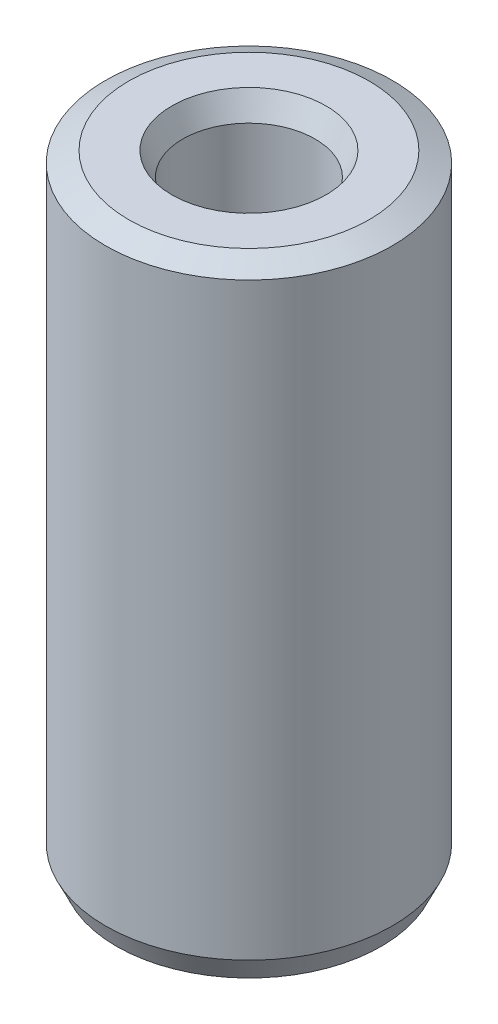
ISO-10303-21;
HEADER;
FILE_DESCRIPTION(('STEP AP214'),'2;1');
FILE_NAME('part.step','',(''),(''),'','','');
FILE_SCHEMA(('AUTOMOTIVE_DESIGN { 1 0 10303 214 1 1 1 1 }'));
ENDSEC;
DATA;
#1=APPLICATION_CONTEXT('core data for automotive mechanical design processes');
#2=APPLICATION_PROTOCOL_DEFINITION('international standard','automotive_design',2000,#1);
#3=PRODUCT_CONTEXT('',#1,'mechanical');
#4=PRODUCT('Part','Part','',(#3));
#5=PRODUCT_RELATED_PRODUCT_CATEGORY('part','',(#4));
#6=PRODUCT_DEFINITION_FORMATION('','',#4);
#7=PRODUCT_DEFINITION_CONTEXT('part definition',#1,'design');
#8=PRODUCT_DEFINITION('design','',#6,#7);
#9=PRODUCT_DEFINITION_SHAPE('','',#8);
#10=(LENGTH_UNIT() NAMED_UNIT(*) SI_UNIT(.MILLI.,.METRE.));
#11=(NAMED_UNIT(*) PLANE_ANGLE_UNIT() SI_UNIT($,.RADIAN.));
#12=(NAMED_UNIT(*) SI_UNIT($,.STERADIAN.) SOLID_ANGLE_UNIT());
#13=UNCERTAINTY_MEASURE_WITH_UNIT(LENGTH_MEASURE(1.E-05),#10,'distance_accuracy_value','');
#14=(GEOMETRIC_REPRESENTATION_CONTEXT(3) GLOBAL_UNCERTAINTY_ASSIGNED_CONTEXT((#13)) GLOBAL_UNIT_ASSIGNED_CONTEXT((#10,
#11,#12)) REPRESENTATION_CONTEXT('',''));
#15=CARTESIAN_POINT('',(0.,0.,0.));
#16=DIRECTION('',(0.,0.,1.));
#17=DIRECTION('',(1.,0.,0.));
#18=AXIS2_PLACEMENT_3D('',#15,#16,#17);
#19=CARTESIAN_POINT('',(0.,173.891652713497,0.));
#20=DIRECTION('',(0.,-1.,0.));
#21=DIRECTION('',(0.,0.,-1.));
#22=AXIS2_PLACEMENT_3D('',#19,#20,#21);
#23=CYLINDRICAL_SURFACE('',#22,40.);
#24=CARTESIAN_POINT('',(0.,6.46707566473601,0.));
#25=DIRECTION('',(0.,1.,0.));
#26=DIRECTION('',(0.,0.,1.));
#27=AXIS2_PLACEMENT_3D('',#24,#25,#26);
#28=CIRCLE('',#27,40.);
#29=CARTESIAN_POINT('',(0.,6.46707566473601,40.));
#30=VERTEX_POINT('',#29);
#31=EDGE_CURVE('E10',#30,#30,#28,.T.);
#32=ORIENTED_EDGE('',*,*,#31,.T.);
#33=EDGE_LOOP('',(#32));
#34=FACE_BOUND('',#33,.T.);
#35=CARTESIAN_POINT('',(0.,170.829040781073,0.));
#36=DIRECTION('',(0.,1.,0.));
#37=DIRECTION('',(0.,0.,1.));
#38=AXIS2_PLACEMENT_3D('',#35,#36,#37);
#39=CIRCLE('',#38,40.);
#40=CARTESIAN_POINT('',(0.,170.829040781073,40.));
#41=VERTEX_POINT('',#40);
#42=EDGE_CURVE('E50',#41,#41,#39,.F.);
#43=ORIENTED_EDGE('',*,*,#42,.T.);
#44=EDGE_LOOP('',(#43));
#45=FACE_BOUND('',#44,.T.);
#46=ADVANCED_FACE('F39',(#34,#45),#23,.T.);
#47=CARTESIAN_POINT('',(0.,173.891652713497,0.));
#48=DIRECTION('',(0.,1.,0.));
#49=DIRECTION('',(0.,0.,1.));
#50=AXIS2_PLACEMENT_3D('',#47,#48,#49);
#51=PLANE('',#50);
#52=CARTESIAN_POINT('',(0.,173.891652713497,0.));
#53=DIRECTION('',(0.,1.,0.));
#54=DIRECTION('',(0.,0.,1.));
#55=AXIS2_PLACEMENT_3D('',#52,#53,#54);
#56=CIRCLE('',#55,21.5167666267869);
#57=CARTESIAN_POINT('',(0.,173.891652713497,21.5167666267869));
#58=VERTEX_POINT('',#57);
#59=EDGE_CURVE('E58',#58,#58,#56,.F.);
#60=ORIENTED_EDGE('',*,*,#59,.T.);
#61=EDGE_LOOP('',(#60));
#62=FACE_BOUND('',#61,.T.);
#63=CARTESIAN_POINT('',(0.,173.891652713497,0.));
#64=DIRECTION('',(0.,1.,0.));
#65=DIRECTION('',(0.,0.,1.));
#66=AXIS2_PLACEMENT_3D('',#63,#64,#65);
#67=CIRCLE('',#66,33.5329243352639);
#68=CARTESIAN_POINT('',(0.,173.891652713497,33.5329243352639));
#69=VERTEX_POINT('',#68);
#70=EDGE_CURVE('E61',#69,#69,#67,.T.);
#71=ORIENTED_EDGE('',*,*,#70,.T.);
#72=EDGE_LOOP('',(#71));
#73=FACE_BOUND('',#72,.T.);
#74=ADVANCED_FACE('F88',(#62,#73),#51,.T.);
#75=CARTESIAN_POINT('',(0.,0.,0.));
#76=DIRECTION('',(0.,1.,0.));
#77=DIRECTION('',(0.,0.,1.));
#78=AXIS2_PLACEMENT_3D('',#75,#76,#77);
#79=PLANE('',#78);
#80=CARTESIAN_POINT('',(0.,0.,0.));
#81=DIRECTION('',(0.,1.,0.));
#82=DIRECTION('',(0.,0.,1.));
#83=AXIS2_PLACEMENT_3D('',#80,#81,#82);
#84=CIRCLE('',#83,24.9212303590988);
#85=CARTESIAN_POINT('',(0.,0.,24.9212303590988));
#86=VERTEX_POINT('',#85);
#87=EDGE_CURVE('E51',#86,#86,#84,.T.);
#88=ORIENTED_EDGE('',*,*,#87,.T.);
#89=EDGE_LOOP('',(#88));
#90=FACE_BOUND('',#89,.T.);
#91=CARTESIAN_POINT('',(0.,0.,0.));
#92=DIRECTION('',(0.,1.,0.));
#93=DIRECTION('',(0.,0.,1.));
#94=AXIS2_PLACEMENT_3D('',#91,#92,#93);
#95=CIRCLE('',#94,36.9373880675759);
#96=CARTESIAN_POINT('',(0.,0.,36.9373880675759));
#97=VERTEX_POINT('',#96);
#98=EDGE_CURVE('E54',#97,#97,#95,.F.);
#99=ORIENTED_EDGE('',*,*,#98,.T.);
#100=EDGE_LOOP('',(#99));
#101=FACE_BOUND('',#100,.T.);
#102=ADVANCED_FACE('F83',(#90,#101),#79,.F.);
#103=CARTESIAN_POINT('',(0.,173.891652713497,0.));
#104=DIRECTION('',(0.,-1.,0.));
#105=DIRECTION('',(0.,0.,-1.));
#106=AXIS2_PLACEMENT_3D('',#103,#104,#105);
#107=CYLINDRICAL_SURFACE('',#106,18.4541546943627);
#108=CARTESIAN_POINT('',(0.,167.424577048761,0.));
#109=DIRECTION('',(0.,1.,0.));
#110=DIRECTION('',(0.,0.,1.));
#111=AXIS2_PLACEMENT_3D('',#108,#109,#110);
#112=CIRCLE('',#111,18.4541546943627);
#113=CARTESIAN_POINT('',(0.,167.424577048761,18.4541546943627));
#114=VERTEX_POINT('',#113);
#115=EDGE_CURVE('E67',#114,#114,#112,.T.);
#116=ORIENTED_EDGE('',*,*,#115,.T.);
#117=EDGE_LOOP('',(#116));
#118=FACE_BOUND('',#117,.T.);
#119=CARTESIAN_POINT('',(0.,3.06261193242416,0.));
#120=DIRECTION('',(0.,1.,0.));
#121=DIRECTION('',(0.,0.,1.));
#122=AXIS2_PLACEMENT_3D('',#119,#120,#121);
#123=CIRCLE('',#122,18.4541546943627);
#124=CARTESIAN_POINT('',(0.,3.06261193242416,18.4541546943627));
#125=VERTEX_POINT('',#124);
#126=EDGE_CURVE('E69',#125,#125,#123,.F.);
#127=ORIENTED_EDGE('',*,*,#126,.T.);
#128=EDGE_LOOP('',(#127));
#129=FACE_BOUND('',#128,.T.);
#130=ADVANCED_FACE('F71',(#118,#129),#107,.F.);
#131=CARTESIAN_POINT('',(0.,167.424577048761,0.));
#132=DIRECTION('',(0.,1.,0.));
#133=DIRECTION('',(0.,0.,1.));
#134=AXIS2_PLACEMENT_3D('',#131,#132,#133);
#135=CONICAL_SURFACE('',#134,18.4541546943627,0.4422808006256);
#136=ORIENTED_EDGE('',*,*,#59,.F.);
#137=EDGE_LOOP('',(#136));
#138=FACE_BOUND('',#137,.T.);
#139=ORIENTED_EDGE('',*,*,#115,.F.);
#140=EDGE_LOOP('',(#139));
#141=FACE_BOUND('',#140,.T.);
#142=ADVANCED_FACE('F77',(#138,#141),#135,.F.);
#143=CARTESIAN_POINT('',(0.,0.,0.));
#144=DIRECTION('',(0.,-1.,0.));
#145=DIRECTION('',(0.,0.,-1.));
#146=AXIS2_PLACEMENT_3D('',#143,#144,#145);
#147=CONICAL_SURFACE('',#146,24.9212303590988,1.12851552616929);
#148=ORIENTED_EDGE('',*,*,#126,.F.);
#149=EDGE_LOOP('',(#148));
#150=FACE_BOUND('',#149,.T.);
#151=ORIENTED_EDGE('',*,*,#87,.F.);
#152=EDGE_LOOP('',(#151));
#153=FACE_BOUND('',#152,.T.);
#154=ADVANCED_FACE('F73',(#150,#153),#147,.F.);
#155=CARTESIAN_POINT('',(0.,6.46707566473601,0.));
#156=DIRECTION('',(0.,1.,0.));
#157=DIRECTION('',(0.,0.,1.));
#158=AXIS2_PLACEMENT_3D('',#155,#156,#157);
#159=CONICAL_SURFACE('',#158,40.,0.442280800625605);
#160=ORIENTED_EDGE('',*,*,#98,.F.);
#161=EDGE_LOOP('',(#160));
#162=FACE_BOUND('',#161,.T.);
#163=ORIENTED_EDGE('',*,*,#31,.F.);
#164=EDGE_LOOP('',(#163));
#165=FACE_BOUND('',#164,.T.);
#166=ADVANCED_FACE('F76',(#162,#165),#159,.T.);
#167=CARTESIAN_POINT('',(0.,173.891652713497,0.));
#168=DIRECTION('',(0.,-1.,0.));
#169=DIRECTION('',(0.,0.,-1.));
#170=AXIS2_PLACEMENT_3D('',#167,#168,#169);
#171=CONICAL_SURFACE('',#170,33.5329243352639,1.12851552616929);
#172=ORIENTED_EDGE('',*,*,#42,.F.);
#173=EDGE_LOOP('',(#172));
#174=FACE_BOUND('',#173,.T.);
#175=ORIENTED_EDGE('',*,*,#70,.F.);
#176=EDGE_LOOP('',(#175));
#177=FACE_BOUND('',#176,.T.);
#178=ADVANCED_FACE('F45',(#174,#177),#171,.T.);
#179=CLOSED_SHELL('',(#46,#74,#102,#130,#142,#154,#166,#178));
#180=MANIFOLD_SOLID_BREP('B2',#179);
#181=ADVANCED_BREP_SHAPE_REPRESENTATION('',(#18,#180),#14);
#182=SHAPE_DEFINITION_REPRESENTATION(#9,#181);
ENDSEC;
END-ISO-10303-21;
